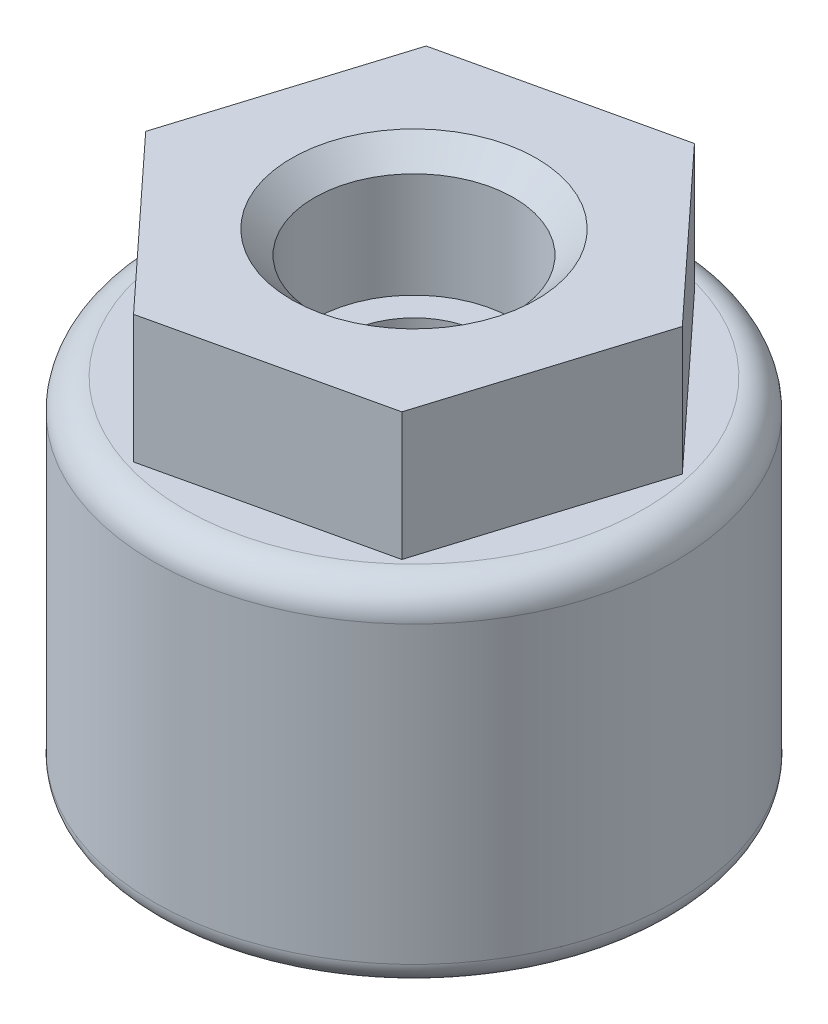
ISO-10303-21;
HEADER;
FILE_DESCRIPTION(('STEP AP214'),'2;1');
FILE_NAME('part.step','',(''),(''),'','','');
FILE_SCHEMA(('AUTOMOTIVE_DESIGN { 1 0 10303 214 1 1 1 1 }'));
ENDSEC;
DATA;
#1=APPLICATION_CONTEXT('core data for automotive mechanical design processes');
#2=APPLICATION_PROTOCOL_DEFINITION('international standard','automotive_design',2000,#1);
#3=PRODUCT_CONTEXT('',#1,'mechanical');
#4=PRODUCT('Part','Part','',(#3));
#5=PRODUCT_RELATED_PRODUCT_CATEGORY('part','',(#4));
#6=PRODUCT_DEFINITION_FORMATION('','',#4);
#7=PRODUCT_DEFINITION_CONTEXT('part definition',#1,'design');
#8=PRODUCT_DEFINITION('design','',#6,#7);
#9=PRODUCT_DEFINITION_SHAPE('','',#8);
#10=(LENGTH_UNIT() NAMED_UNIT(*) SI_UNIT(.MILLI.,.METRE.));
#11=(NAMED_UNIT(*) PLANE_ANGLE_UNIT() SI_UNIT($,.RADIAN.));
#12=(NAMED_UNIT(*) SI_UNIT($,.STERADIAN.) SOLID_ANGLE_UNIT());
#13=UNCERTAINTY_MEASURE_WITH_UNIT(LENGTH_MEASURE(1.E-05),#10,'distance_accuracy_value','');
#14=(GEOMETRIC_REPRESENTATION_CONTEXT(3) GLOBAL_UNCERTAINTY_ASSIGNED_CONTEXT((#13)) GLOBAL_UNIT_ASSIGNED_CONTEXT((#10,
#11,#12)) REPRESENTATION_CONTEXT('',''));
#15=CARTESIAN_POINT('',(0.,0.,0.));
#16=DIRECTION('',(0.,0.,1.));
#17=DIRECTION('',(1.,0.,0.));
#18=AXIS2_PLACEMENT_3D('',#15,#16,#17);
#19=CARTESIAN_POINT('',(0.,28.12,0.));
#20=DIRECTION('',(0.,-1.,0.));
#21=DIRECTION('',(0.,0.,-1.));
#22=AXIS2_PLACEMENT_3D('',#19,#20,#21);
#23=CYLINDRICAL_SURFACE('',#22,3.95);
#24=CARTESIAN_POINT('',(0.,0.,0.));
#25=DIRECTION('',(0.,1.,0.));
#26=DIRECTION('',(0.,0.,1.));
#27=AXIS2_PLACEMENT_3D('',#24,#25,#26);
#28=CIRCLE('',#27,3.95);
#29=CARTESIAN_POINT('',(0.,0.,3.95));
#30=VERTEX_POINT('',#29);
#31=EDGE_CURVE('E122',#30,#30,#28,.F.);
#32=ORIENTED_EDGE('',*,*,#31,.T.);
#33=EDGE_LOOP('',(#32));
#34=FACE_BOUND('',#33,.T.);
#35=CARTESIAN_POINT('',(0.,19.1,0.));
#36=DIRECTION('',(0.,1.,0.));
#37=DIRECTION('',(0.,0.,1.));
#38=AXIS2_PLACEMENT_3D('',#35,#36,#37);
#39=CIRCLE('',#38,3.95);
#40=CARTESIAN_POINT('',(0.,19.1,3.95));
#41=VERTEX_POINT('',#40);
#42=EDGE_CURVE('E151',#41,#41,#39,.T.);
#43=ORIENTED_EDGE('',*,*,#42,.T.);
#44=EDGE_LOOP('',(#43));
#45=FACE_BOUND('',#44,.T.);
#46=ADVANCED_FACE('F34',(#34,#45),#23,.F.);
#47=CARTESIAN_POINT('',(0.,19.1,0.));
#48=DIRECTION('',(0.,1.,0.));
#49=DIRECTION('',(0.,0.,1.));
#50=AXIS2_PLACEMENT_3D('',#47,#48,#49);
#51=PLANE('',#50);
#52=CARTESIAN_POINT('',(0.,19.1,0.));
#53=DIRECTION('',(0.,1.,0.));
#54=DIRECTION('',(0.,0.,1.));
#55=AXIS2_PLACEMENT_3D('',#52,#53,#54);
#56=CIRCLE('',#55,12.615);
#57=CARTESIAN_POINT('',(0.,19.1,12.615));
#58=VERTEX_POINT('',#57);
#59=EDGE_CURVE('E139',#58,#58,#56,.T.);
#60=ORIENTED_EDGE('',*,*,#59,.T.);
#61=EDGE_LOOP('',(#60));
#62=FACE_BOUND('',#61,.T.);
#63=DIRECTION('',(0.295603112883021,0.,-0.955310839284192));
#64=VECTOR('',#63,1.);
#65=CARTESIAN_POINT('',(8.36430826452093,19.1,9.03064120588353));
#66=LINE('',#65,#64);
#67=CARTESIAN_POINT('',(8.36430826452093,19.1,9.03064120588353));
#68=VERTEX_POINT('',#67);
#69=CARTESIAN_POINT('',(12.0029188290181,19.1,-2.72838283921749));
#70=VERTEX_POINT('',#69);
#71=EDGE_CURVE('E121',#68,#70,#66,.T.);
#72=ORIENTED_EDGE('',*,*,#71,.F.);
#73=DIRECTION('',(0.975125011772254,0.,-0.221655614447641));
#74=VECTOR('',#73,1.);
#75=CARTESIAN_POINT('',(-3.63861056449721,19.1,11.759024045101));
#76=LINE('',#75,#74);
#77=CARTESIAN_POINT('',(-3.63861056449721,19.1,11.759024045101));
#78=VERTEX_POINT('',#77);
#79=EDGE_CURVE('E118',#78,#68,#76,.T.);
#80=ORIENTED_EDGE('',*,*,#79,.F.);
#81=DIRECTION('',(0.679521898889233,0.,0.733655224836551));
#82=VECTOR('',#81,1.);
#83=CARTESIAN_POINT('',(-12.0029188290181,19.1,2.7283828392175));
#84=LINE('',#83,#82);
#85=CARTESIAN_POINT('',(-12.0029188290181,19.1,2.7283828392175));
#86=VERTEX_POINT('',#85);
#87=EDGE_CURVE('E77',#86,#78,#84,.T.);
#88=ORIENTED_EDGE('',*,*,#87,.F.);
#89=DIRECTION('',(-0.295603112883021,0.,0.955310839284192));
#90=VECTOR('',#89,1.);
#91=CARTESIAN_POINT('',(-8.36430826452093,19.1,-9.03064120588352));
#92=LINE('',#91,#90);
#93=CARTESIAN_POINT('',(-8.36430826452093,19.1,-9.03064120588352));
#94=VERTEX_POINT('',#93);
#95=EDGE_CURVE('E127',#94,#86,#92,.T.);
#96=ORIENTED_EDGE('',*,*,#95,.F.);
#97=DIRECTION('',(-0.975125011772254,0.,0.221655614447641));
#98=VECTOR('',#97,1.);
#99=CARTESIAN_POINT('',(3.6386105644972,19.1,-11.759024045101));
#100=LINE('',#99,#98);
#101=CARTESIAN_POINT('',(3.6386105644972,19.1,-11.759024045101));
#102=VERTEX_POINT('',#101);
#103=EDGE_CURVE('E107',#102,#94,#100,.T.);
#104=ORIENTED_EDGE('',*,*,#103,.F.);
#105=DIRECTION('',(-0.679521898889233,0.,-0.733655224836551));
#106=VECTOR('',#105,1.);
#107=CARTESIAN_POINT('',(12.0029188290181,19.1,-2.72838283921749));
#108=LINE('',#107,#106);
#109=EDGE_CURVE('E124',#70,#102,#108,.T.);
#110=ORIENTED_EDGE('',*,*,#109,.F.);
#111=EDGE_LOOP('',(#72,#80,#88,#96,#104,#110));
#112=FACE_BOUND('',#111,.T.);
#113=ADVANCED_FACE('F170',(#62,#112),#51,.T.);
#114=CARTESIAN_POINT('',(0.,19.1,0.));
#115=DIRECTION('',(0.,-1.,0.));
#116=DIRECTION('',(0.,0.,-1.));
#117=AXIS2_PLACEMENT_3D('',#114,#115,#116);
#118=CYLINDRICAL_SURFACE('',#117,14.285);
#119=CARTESIAN_POINT('',(0.,1.25,0.));
#120=DIRECTION('',(0.,1.,0.));
#121=DIRECTION('',(0.,0.,1.));
#122=AXIS2_PLACEMENT_3D('',#119,#120,#121);
#123=CIRCLE('',#122,14.285);
#124=CARTESIAN_POINT('',(0.,1.25,14.285));
#125=VERTEX_POINT('',#124);
#126=EDGE_CURVE('E145',#125,#125,#123,.T.);
#127=ORIENTED_EDGE('',*,*,#126,.T.);
#128=EDGE_LOOP('',(#127));
#129=FACE_BOUND('',#128,.T.);
#130=CARTESIAN_POINT('',(0.,17.43,0.));
#131=DIRECTION('',(0.,1.,0.));
#132=DIRECTION('',(0.,0.,1.));
#133=AXIS2_PLACEMENT_3D('',#130,#131,#132);
#134=CIRCLE('',#133,14.285);
#135=CARTESIAN_POINT('',(0.,17.43,14.285));
#136=VERTEX_POINT('',#135);
#137=EDGE_CURVE('E142',#136,#136,#134,.F.);
#138=ORIENTED_EDGE('',*,*,#137,.T.);
#139=EDGE_LOOP('',(#138));
#140=FACE_BOUND('',#139,.T.);
#141=ADVANCED_FACE('F176',(#129,#140),#118,.T.);
#142=CARTESIAN_POINT('',(0.,0.,0.));
#143=DIRECTION('',(0.,1.,0.));
#144=DIRECTION('',(0.,0.,1.));
#145=AXIS2_PLACEMENT_3D('',#142,#143,#144);
#146=PLANE('',#145);
#147=ORIENTED_EDGE('',*,*,#31,.F.);
#148=EDGE_LOOP('',(#147));
#149=FACE_BOUND('',#148,.T.);
#150=CARTESIAN_POINT('',(0.,0.,0.));
#151=DIRECTION('',(0.,1.,0.));
#152=DIRECTION('',(0.,0.,1.));
#153=AXIS2_PLACEMENT_3D('',#150,#151,#152);
#154=CIRCLE('',#153,13.035);
#155=CARTESIAN_POINT('',(0.,0.,13.035));
#156=VERTEX_POINT('',#155);
#157=EDGE_CURVE('E148',#156,#156,#154,.F.);
#158=ORIENTED_EDGE('',*,*,#157,.T.);
#159=EDGE_LOOP('',(#158));
#160=FACE_BOUND('',#159,.T.);
#161=ADVANCED_FACE('F205',(#149,#160),#146,.F.);
#162=CARTESIAN_POINT('',(0.,17.43,0.));
#163=DIRECTION('',(0.,1.,0.));
#164=DIRECTION('',(0.,0.,1.));
#165=AXIS2_PLACEMENT_3D('',#162,#163,#164);
#166=TOROIDAL_SURFACE('',#165,12.615,1.67);
#167=ORIENTED_EDGE('',*,*,#137,.F.);
#168=EDGE_LOOP('',(#167));
#169=FACE_BOUND('',#168,.T.);
#170=ORIENTED_EDGE('',*,*,#59,.F.);
#171=EDGE_LOOP('',(#170));
#172=FACE_BOUND('',#171,.T.);
#173=ADVANCED_FACE('F208',(#169,#172),#166,.T.);
#174=CARTESIAN_POINT('',(0.,1.25,0.));
#175=DIRECTION('',(0.,1.,0.));
#176=DIRECTION('',(0.,0.,1.));
#177=AXIS2_PLACEMENT_3D('',#174,#175,#176);
#178=TOROIDAL_SURFACE('',#177,13.035,1.25);
#179=ORIENTED_EDGE('',*,*,#157,.F.);
#180=EDGE_LOOP('',(#179));
#181=FACE_BOUND('',#180,.T.);
#182=ORIENTED_EDGE('',*,*,#126,.F.);
#183=EDGE_LOOP('',(#182));
#184=FACE_BOUND('',#183,.T.);
#185=ADVANCED_FACE('F202',(#181,#184),#178,.T.);
#186=CARTESIAN_POINT('',(-3.63861056449721,26.12,11.759024045101));
#187=DIRECTION('',(-0.221655614447641,0.,-0.975125011772254));
#188=DIRECTION('',(-0.975125011772254,0.,0.221655614447641));
#189=AXIS2_PLACEMENT_3D('',#186,#187,#188);
#190=PLANE('',#189);
#191=ORIENTED_EDGE('',*,*,#79,.T.);
#192=DIRECTION('',(0.,-1.,0.));
#193=VECTOR('',#192,1.);
#194=CARTESIAN_POINT('',(8.36430826452093,26.12,9.03064120588353));
#195=LINE('',#194,#193);
#196=CARTESIAN_POINT('',(8.36430826452093,26.12,9.03064120588353));
#197=VERTEX_POINT('',#196);
#198=EDGE_CURVE('E137',#197,#68,#195,.T.);
#199=ORIENTED_EDGE('',*,*,#198,.F.);
#200=DIRECTION('',(0.975125011772254,0.,-0.221655614447641));
#201=VECTOR('',#200,1.);
#202=CARTESIAN_POINT('',(-3.63861056449721,26.12,11.759024045101));
#203=LINE('',#202,#201);
#204=CARTESIAN_POINT('',(-3.63861056449721,26.12,11.759024045101));
#205=VERTEX_POINT('',#204);
#206=EDGE_CURVE('E130',#205,#197,#203,.T.);
#207=ORIENTED_EDGE('',*,*,#206,.F.);
#208=DIRECTION('',(0.,-1.,0.));
#209=VECTOR('',#208,1.);
#210=CARTESIAN_POINT('',(-3.63861056449721,26.12,11.759024045101));
#211=LINE('',#210,#209);
#212=EDGE_CURVE('E114',#205,#78,#211,.T.);
#213=ORIENTED_EDGE('',*,*,#212,.T.);
#214=EDGE_LOOP('',(#191,#199,#207,#213));
#215=FACE_BOUND('',#214,.T.);
#216=ADVANCED_FACE('F200',(#215),#190,.F.);
#217=CARTESIAN_POINT('',(8.36430826452093,26.12,9.03064120588353));
#218=DIRECTION('',(-0.955310839284192,0.,-0.295603112883021));
#219=DIRECTION('',(-0.295603112883021,0.,0.955310839284192));
#220=AXIS2_PLACEMENT_3D('',#217,#218,#219);
#221=PLANE('',#220);
#222=ORIENTED_EDGE('',*,*,#71,.T.);
#223=DIRECTION('',(0.,-1.,0.));
#224=VECTOR('',#223,1.);
#225=CARTESIAN_POINT('',(12.0029188290181,26.12,-2.72838283921749));
#226=LINE('',#225,#224);
#227=CARTESIAN_POINT('',(12.0029188290181,26.12,-2.72838283921749));
#228=VERTEX_POINT('',#227);
#229=EDGE_CURVE('E134',#228,#70,#226,.T.);
#230=ORIENTED_EDGE('',*,*,#229,.F.);
#231=DIRECTION('',(0.295603112883021,0.,-0.955310839284192));
#232=VECTOR('',#231,1.);
#233=CARTESIAN_POINT('',(8.36430826452093,26.12,9.03064120588353));
#234=LINE('',#233,#232);
#235=EDGE_CURVE('E85',#197,#228,#234,.T.);
#236=ORIENTED_EDGE('',*,*,#235,.F.);
#237=ORIENTED_EDGE('',*,*,#198,.T.);
#238=EDGE_LOOP('',(#222,#230,#236,#237));
#239=FACE_BOUND('',#238,.T.);
#240=ADVANCED_FACE('F196',(#239),#221,.F.);
#241=CARTESIAN_POINT('',(12.0029188290181,26.12,-2.72838283921749));
#242=DIRECTION('',(-0.733655224836551,0.,0.679521898889233));
#243=DIRECTION('',(0.679521898889233,0.,0.733655224836551));
#244=AXIS2_PLACEMENT_3D('',#241,#242,#243);
#245=PLANE('',#244);
#246=ORIENTED_EDGE('',*,*,#109,.T.);
#247=DIRECTION('',(0.,-1.,0.));
#248=VECTOR('',#247,1.);
#249=CARTESIAN_POINT('',(3.6386105644972,26.12,-11.759024045101));
#250=LINE('',#249,#248);
#251=CARTESIAN_POINT('',(3.6386105644972,26.12,-11.759024045101));
#252=VERTEX_POINT('',#251);
#253=EDGE_CURVE('E110',#252,#102,#250,.T.);
#254=ORIENTED_EDGE('',*,*,#253,.F.);
#255=DIRECTION('',(-0.679521898889233,0.,-0.733655224836551));
#256=VECTOR('',#255,1.);
#257=CARTESIAN_POINT('',(12.0029188290181,26.12,-2.72838283921749));
#258=LINE('',#257,#256);
#259=EDGE_CURVE('E98',#228,#252,#258,.T.);
#260=ORIENTED_EDGE('',*,*,#259,.F.);
#261=ORIENTED_EDGE('',*,*,#229,.T.);
#262=EDGE_LOOP('',(#246,#254,#260,#261));
#263=FACE_BOUND('',#262,.T.);
#264=ADVANCED_FACE('F193',(#263),#245,.F.);
#265=CARTESIAN_POINT('',(3.6386105644972,26.12,-11.759024045101));
#266=DIRECTION('',(0.221655614447641,0.,0.975125011772254));
#267=DIRECTION('',(0.975125011772254,0.,-0.221655614447641));
#268=AXIS2_PLACEMENT_3D('',#265,#266,#267);
#269=PLANE('',#268);
#270=ORIENTED_EDGE('',*,*,#103,.T.);
#271=DIRECTION('',(0.,-1.,0.));
#272=VECTOR('',#271,1.);
#273=CARTESIAN_POINT('',(-8.36430826452093,26.12,-9.03064120588352));
#274=LINE('',#273,#272);
#275=CARTESIAN_POINT('',(-8.36430826452093,26.12,-9.03064120588352));
#276=VERTEX_POINT('',#275);
#277=EDGE_CURVE('E104',#276,#94,#274,.T.);
#278=ORIENTED_EDGE('',*,*,#277,.F.);
#279=DIRECTION('',(-0.975125011772254,0.,0.221655614447641));
#280=VECTOR('',#279,1.);
#281=CARTESIAN_POINT('',(3.6386105644972,26.12,-11.759024045101));
#282=LINE('',#281,#280);
#283=EDGE_CURVE('E92',#252,#276,#282,.T.);
#284=ORIENTED_EDGE('',*,*,#283,.F.);
#285=ORIENTED_EDGE('',*,*,#253,.T.);
#286=EDGE_LOOP('',(#270,#278,#284,#285));
#287=FACE_BOUND('',#286,.T.);
#288=ADVANCED_FACE('F105',(#287),#269,.F.);
#289=CARTESIAN_POINT('',(-8.36430826452093,26.12,-9.03064120588352));
#290=DIRECTION('',(0.955310839284192,0.,0.295603112883021));
#291=DIRECTION('',(0.295603112883021,0.,-0.955310839284192));
#292=AXIS2_PLACEMENT_3D('',#289,#290,#291);
#293=PLANE('',#292);
#294=ORIENTED_EDGE('',*,*,#95,.T.);
#295=DIRECTION('',(0.,-1.,0.));
#296=VECTOR('',#295,1.);
#297=CARTESIAN_POINT('',(-12.0029188290181,26.12,2.7283828392175));
#298=LINE('',#297,#296);
#299=CARTESIAN_POINT('',(-12.0029188290181,26.12,2.7283828392175));
#300=VERTEX_POINT('',#299);
#301=EDGE_CURVE('E49',#300,#86,#298,.T.);
#302=ORIENTED_EDGE('',*,*,#301,.F.);
#303=DIRECTION('',(-0.295603112883021,0.,0.955310839284192));
#304=VECTOR('',#303,1.);
#305=CARTESIAN_POINT('',(-8.36430826452093,26.12,-9.03064120588352));
#306=LINE('',#305,#304);
#307=EDGE_CURVE('E96',#276,#300,#306,.T.);
#308=ORIENTED_EDGE('',*,*,#307,.F.);
#309=ORIENTED_EDGE('',*,*,#277,.T.);
#310=EDGE_LOOP('',(#294,#302,#308,#309));
#311=FACE_BOUND('',#310,.T.);
#312=ADVANCED_FACE('F112',(#311),#293,.F.);
#313=CARTESIAN_POINT('',(-12.0029188290181,26.12,2.7283828392175));
#314=DIRECTION('',(0.733655224836551,0.,-0.679521898889233));
#315=DIRECTION('',(-0.679521898889233,0.,-0.733655224836551));
#316=AXIS2_PLACEMENT_3D('',#313,#314,#315);
#317=PLANE('',#316);
#318=ORIENTED_EDGE('',*,*,#87,.T.);
#319=ORIENTED_EDGE('',*,*,#212,.F.);
#320=DIRECTION('',(0.679521898889233,0.,0.733655224836551));
#321=VECTOR('',#320,1.);
#322=CARTESIAN_POINT('',(-12.0029188290181,26.12,2.7283828392175));
#323=LINE('',#322,#321);
#324=EDGE_CURVE('E57',#300,#205,#323,.T.);
#325=ORIENTED_EDGE('',*,*,#324,.F.);
#326=ORIENTED_EDGE('',*,*,#301,.T.);
#327=EDGE_LOOP('',(#318,#319,#325,#326));
#328=FACE_BOUND('',#327,.T.);
#329=ADVANCED_FACE('F185',(#328),#317,.F.);
#330=CARTESIAN_POINT('',(0.,26.12,0.));
#331=DIRECTION('',(0.,1.,0.));
#332=DIRECTION('',(0.,0.,1.));
#333=AXIS2_PLACEMENT_3D('',#330,#331,#332);
#334=PLANE('',#333);
#335=CARTESIAN_POINT('',(0.,26.12,0.));
#336=DIRECTION('',(0.,1.,0.));
#337=DIRECTION('',(0.,0.,1.));
#338=AXIS2_PLACEMENT_3D('',#335,#336,#337);
#339=CIRCLE('',#338,6.725);
#340=CARTESIAN_POINT('',(0.,26.12,6.725));
#341=VERTEX_POINT('',#340);
#342=EDGE_CURVE('E11',#341,#341,#339,.F.);
#343=ORIENTED_EDGE('',*,*,#342,.T.);
#344=EDGE_LOOP('',(#343));
#345=FACE_BOUND('',#344,.T.);
#346=ORIENTED_EDGE('',*,*,#206,.T.);
#347=ORIENTED_EDGE('',*,*,#235,.T.);
#348=ORIENTED_EDGE('',*,*,#259,.T.);
#349=ORIENTED_EDGE('',*,*,#283,.T.);
#350=ORIENTED_EDGE('',*,*,#307,.T.);
#351=ORIENTED_EDGE('',*,*,#324,.T.);
#352=EDGE_LOOP('',(#346,#347,#348,#349,#350,#351));
#353=FACE_BOUND('',#352,.T.);
#354=ADVANCED_FACE('F94',(#345,#353),#334,.T.);
#355=CARTESIAN_POINT('',(0.,19.1,0.));
#356=DIRECTION('',(0.,1.,0.));
#357=DIRECTION('',(0.,0.,1.));
#358=AXIS2_PLACEMENT_3D('',#355,#356,#357);
#359=CYLINDRICAL_SURFACE('',#358,5.475);
#360=CARTESIAN_POINT('',(0.,24.87,0.));
#361=DIRECTION('',(0.,1.,0.));
#362=DIRECTION('',(0.,0.,1.));
#363=AXIS2_PLACEMENT_3D('',#360,#361,#362);
#364=CIRCLE('',#363,5.475);
#365=CARTESIAN_POINT('',(0.,24.87,5.475));
#366=VERTEX_POINT('',#365);
#367=EDGE_CURVE('E42',#366,#366,#364,.T.);
#368=ORIENTED_EDGE('',*,*,#367,.T.);
#369=EDGE_LOOP('',(#368));
#370=FACE_BOUND('',#369,.T.);
#371=CARTESIAN_POINT('',(0.,19.1,0.));
#372=DIRECTION('',(0.,1.,0.));
#373=DIRECTION('',(0.,0.,1.));
#374=AXIS2_PLACEMENT_3D('',#371,#372,#373);
#375=CIRCLE('',#374,5.475);
#376=CARTESIAN_POINT('',(0.,19.1,5.475));
#377=VERTEX_POINT('',#376);
#378=EDGE_CURVE('E153',#377,#377,#375,.T.);
#379=ORIENTED_EDGE('',*,*,#378,.F.);
#380=EDGE_LOOP('',(#379));
#381=FACE_BOUND('',#380,.T.);
#382=ADVANCED_FACE('F157',(#370,#381),#359,.F.);
#383=CARTESIAN_POINT('',(0.,19.1,0.));
#384=DIRECTION('',(0.,1.,0.));
#385=DIRECTION('',(0.,0.,1.));
#386=AXIS2_PLACEMENT_3D('',#383,#384,#385);
#387=PLANE('',#386);
#388=ORIENTED_EDGE('',*,*,#42,.F.);
#389=EDGE_LOOP('',(#388));
#390=FACE_BOUND('',#389,.T.);
#391=ORIENTED_EDGE('',*,*,#378,.T.);
#392=EDGE_LOOP('',(#391));
#393=FACE_BOUND('',#392,.T.);
#394=ADVANCED_FACE('F161',(#390,#393),#387,.T.);
#395=CARTESIAN_POINT('',(0.,24.87,0.));
#396=DIRECTION('',(0.,1.,0.));
#397=DIRECTION('',(0.,0.,1.));
#398=AXIS2_PLACEMENT_3D('',#395,#396,#397);
#399=CONICAL_SURFACE('',#398,5.475,0.785398163397451);
#400=ORIENTED_EDGE('',*,*,#342,.F.);
#401=EDGE_LOOP('',(#400));
#402=FACE_BOUND('',#401,.T.);
#403=ORIENTED_EDGE('',*,*,#367,.F.);
#404=EDGE_LOOP('',(#403));
#405=FACE_BOUND('',#404,.T.);
#406=ADVANCED_FACE('F36',(#402,#405),#399,.F.);
#407=CLOSED_SHELL('',(#46,#113,#141,#161,#173,#185,#216,#240,#264,#288,#312,#329,#354,#382,#394,#406));
#408=MANIFOLD_SOLID_BREP('B2',#407);
#409=ADVANCED_BREP_SHAPE_REPRESENTATION('',(#18,#408),#14);
#410=SHAPE_DEFINITION_REPRESENTATION(#9,#409);
ENDSEC;
END-ISO-10303-21;
